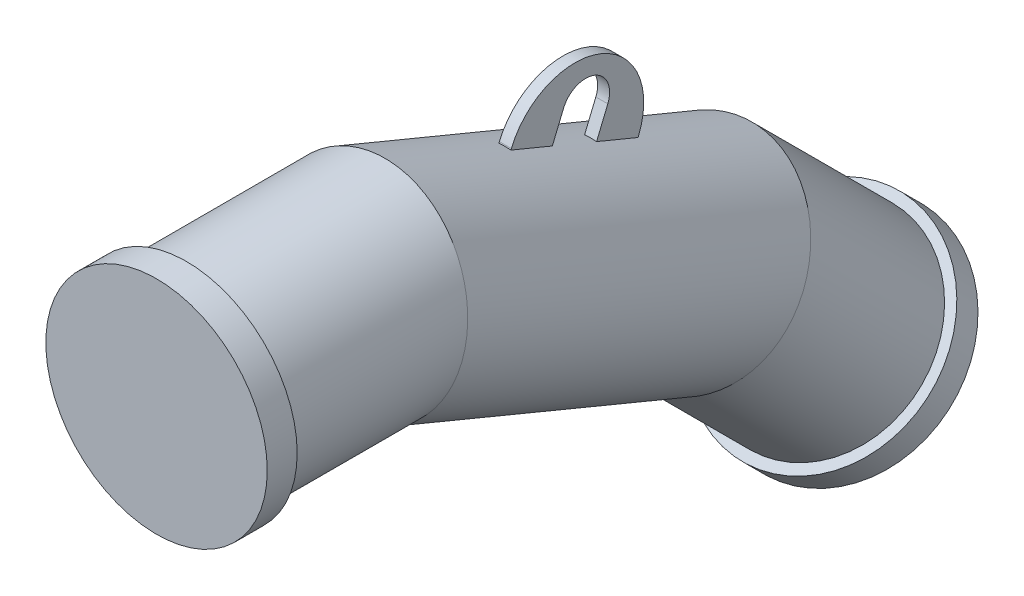
ISO-10303-21;
HEADER;
FILE_DESCRIPTION(('STEP AP214'),'2;1');
FILE_NAME('part.step','',(''),(''),'','','');
FILE_SCHEMA(('AUTOMOTIVE_DESIGN { 1 0 10303 214 1 1 1 1 }'));
ENDSEC;
DATA;
#1=APPLICATION_CONTEXT('core data for automotive mechanical design processes');
#2=APPLICATION_PROTOCOL_DEFINITION('international standard','automotive_design',2000,#1);
#3=PRODUCT_CONTEXT('',#1,'mechanical');
#4=PRODUCT('Part','Part','',(#3));
#5=PRODUCT_RELATED_PRODUCT_CATEGORY('part','',(#4));
#6=PRODUCT_DEFINITION_FORMATION('','',#4);
#7=PRODUCT_DEFINITION_CONTEXT('part definition',#1,'design');
#8=PRODUCT_DEFINITION('design','',#6,#7);
#9=PRODUCT_DEFINITION_SHAPE('','',#8);
#10=(LENGTH_UNIT() NAMED_UNIT(*) SI_UNIT(.MILLI.,.METRE.));
#11=(NAMED_UNIT(*) PLANE_ANGLE_UNIT() SI_UNIT($,.RADIAN.));
#12=(NAMED_UNIT(*) SI_UNIT($,.STERADIAN.) SOLID_ANGLE_UNIT());
#13=UNCERTAINTY_MEASURE_WITH_UNIT(LENGTH_MEASURE(1.E-05),#10,'distance_accuracy_value','');
#14=(GEOMETRIC_REPRESENTATION_CONTEXT(3) GLOBAL_UNCERTAINTY_ASSIGNED_CONTEXT((#13)) GLOBAL_UNIT_ASSIGNED_CONTEXT((#10,
#11,#12)) REPRESENTATION_CONTEXT('',''));
#15=CARTESIAN_POINT('',(0.,0.,0.));
#16=DIRECTION('',(0.,0.,1.));
#17=DIRECTION('',(1.,0.,0.));
#18=AXIS2_PLACEMENT_3D('',#15,#16,#17);
#19=CARTESIAN_POINT('',(0.,-219.669914110089,-555.33008588991));
#20=DIRECTION('',(0.,-0.707106781186548,-0.707106781186547));
#21=DIRECTION('',(-1.,0.,0.));
#22=AXIS2_PLACEMENT_3D('',#19,#20,#21);
#23=CYLINDRICAL_SURFACE('',#22,92.5);
#24=CARTESIAN_POINT('',(0.,-219.669914110089,-555.33008588991));
#25=DIRECTION('',(0.,-0.707106781186548,-0.707106781186547));
#26=DIRECTION('',(-1.,0.,0.));
#27=AXIS2_PLACEMENT_3D('',#24,#25,#26);
#28=CIRCLE('',#27,92.5);
#29=CARTESIAN_POINT('',(-92.5,-219.669914110089,-555.33008588991));
#30=VERTEX_POINT('',#29);
#31=EDGE_CURVE('E26',#30,#30,#28,.T.);
#32=ORIENTED_EDGE('',*,*,#31,.T.);
#33=EDGE_LOOP('',(#32));
#34=FACE_BOUND('',#33,.T.);
#35=CARTESIAN_POINT('',(0.,-237.347583639753,-573.007755419574));
#36=DIRECTION('',(0.,-0.707106781186548,-0.707106781186547));
#37=DIRECTION('',(-1.,0.,0.));
#38=AXIS2_PLACEMENT_3D('',#35,#36,#37);
#39=CIRCLE('',#38,92.5);
#40=CARTESIAN_POINT('',(-92.5,-237.347583639753,-573.007755419574));
#41=VERTEX_POINT('',#40);
#42=EDGE_CURVE('E19',#41,#41,#39,.T.);
#43=ORIENTED_EDGE('',*,*,#42,.F.);
#44=EDGE_LOOP('',(#43));
#45=FACE_BOUND('',#44,.T.);
#46=ADVANCED_FACE('F16',(#34,#45),#23,.T.);
#47=CARTESIAN_POINT('',(0.,-219.669914110089,-555.33008588991));
#48=DIRECTION('',(0.,-0.707106781186548,-0.707106781186547));
#49=DIRECTION('',(-1.,0.,0.));
#50=AXIS2_PLACEMENT_3D('',#47,#48,#49);
#51=PLANE('',#50);
#52=CARTESIAN_POINT('',(0.,-219.669914110089,-555.33008588991));
#53=DIRECTION('',(0.,0.707106781186548,0.707106781186547));
#54=DIRECTION('',(1.,0.,0.));
#55=AXIS2_PLACEMENT_3D('',#52,#53,#54);
#56=CIRCLE('',#55,84.15);
#57=CARTESIAN_POINT('',(84.15,-219.669914110089,-555.33008588991));
#58=VERTEX_POINT('',#57);
#59=EDGE_CURVE('E10',#58,#58,#56,.T.);
#60=ORIENTED_EDGE('',*,*,#59,.F.);
#61=EDGE_LOOP('',(#60));
#62=FACE_BOUND('',#61,.T.);
#63=ORIENTED_EDGE('',*,*,#31,.F.);
#64=EDGE_LOOP('',(#63));
#65=FACE_BOUND('',#64,.T.);
#66=ADVANCED_FACE('F371',(#62,#65),#51,.F.);
#67=CARTESIAN_POINT('',(0.,-114.18070123307,-449.84087301289));
#68=DIRECTION('',(0.,0.382683432365089,0.923879532511287));
#69=DIRECTION('',(0.,-0.923879532511287,0.382683432365089));
#70=AXIS2_PLACEMENT_3D('',#67,#68,#69);
#71=CYLINDRICAL_SURFACE('',#70,84.15);
#72=CARTESIAN_POINT('',(0.,-64.7440192638374,-330.490164924042));
#73=DIRECTION('',(0.,-0.38268343236509,-0.923879532511287));
#74=DIRECTION('',(0.,0.923879532511287,-0.38268343236509));
#75=AXIS2_PLACEMENT_3D('',#72,#73,#74);
#76=CIRCLE('',#75,84.15);
#77=CARTESIAN_POINT('',(-5.,12.8630850479172,-362.636080066475));
#78=VERTEX_POINT('',#77);
#79=CARTESIAN_POINT('',(5.,12.8630850479172,-362.636080066475));
#80=VERTEX_POINT('',#79);
#81=EDGE_CURVE('E343',#78,#80,#76,.T.);
#82=ORIENTED_EDGE('',*,*,#81,.F.);
#83=DIRECTION('',(0.,0.382683432365089,0.923879532511287));
#84=VECTOR('',#83,1.);
#85=CARTESIAN_POINT('',(-5.,-36.5735969213154,-481.986788155322));
#86=LINE('',#85,#84);
#87=CARTESIAN_POINT('',(-5.,-1.48754366577374,-397.281562535648));
#88=VERTEX_POINT('',#87);
#89=EDGE_CURVE('E336',#88,#78,#86,.T.);
#90=ORIENTED_EDGE('',*,*,#89,.F.);
#91=CARTESIAN_POINT('',(0.,-79.0946479775282,-365.135647393216));
#92=DIRECTION('',(0.,0.38268343236509,0.923879532511287));
#93=DIRECTION('',(0.,-0.923879532511287,0.38268343236509));
#94=AXIS2_PLACEMENT_3D('',#91,#92,#93);
#95=CIRCLE('',#94,84.15);
#96=CARTESIAN_POINT('',(5.,-1.48754366577375,-397.281562535648));
#97=VERTEX_POINT('',#96);
#98=EDGE_CURVE('E332',#97,#88,#95,.T.);
#99=ORIENTED_EDGE('',*,*,#98,.F.);
#100=DIRECTION('',(0.,0.382683432365089,0.923879532511287));
#101=VECTOR('',#100,1.);
#102=CARTESIAN_POINT('',(5.,-36.5735969213154,-481.986788155322));
#103=LINE('',#102,#101);
#104=EDGE_CURVE('E340',#97,#80,#103,.T.);
#105=ORIENTED_EDGE('',*,*,#104,.T.);
#106=EDGE_LOOP('',(#82,#90,#99,#105));
#107=FACE_BOUND('',#106,.T.);
#108=CARTESIAN_POINT('',(0.,-114.18070123307,-449.84087301289));
#109=DIRECTION('',(0.,-0.555570233019602,-0.831469612302545));
#110=DIRECTION('',(0.,-0.831469612302546,0.555570233019602));
#111=AXIS2_PLACEMENT_3D('',#108,#109,#110);
#112=ELLIPSE('',#111,85.79859596323,84.15);
#113=CARTESIAN_POINT('',(0.,-185.51962655472,-402.173727060843));
#114=VERTEX_POINT('',#113);
#115=EDGE_CURVE('E320',#114,#114,#112,.T.);
#116=ORIENTED_EDGE('',*,*,#115,.F.);
#117=EDGE_LOOP('',(#116));
#118=FACE_BOUND('',#117,.T.);
#119=CARTESIAN_POINT('',(0.,-2.43121495121452E-13,-174.184275534742));
#120=DIRECTION('',(0.,-0.195090322016128,-0.98078528040323));
#121=DIRECTION('',(0.,-0.980785280403231,0.195090322016128));
#122=AXIS2_PLACEMENT_3D('',#119,#120,#121);
#123=ELLIPSE('',#122,85.79859596323,84.15);
#124=CARTESIAN_POINT('',(0.,-84.1500000000002,-157.445799819743));
#125=VERTEX_POINT('',#124);
#126=EDGE_CURVE('E325',#125,#125,#123,.T.);
#127=ORIENTED_EDGE('',*,*,#126,.T.);
#128=EDGE_LOOP('',(#127));
#129=FACE_BOUND('',#128,.T.);
#130=CARTESIAN_POINT('',(0.,-49.4366819692338,-293.534983623591));
#131=DIRECTION('',(0.,0.38268343236509,0.923879532511287));
#132=DIRECTION('',(0.,-0.923879532511287,0.38268343236509));
#133=AXIS2_PLACEMENT_3D('',#130,#131,#132);
#134=CIRCLE('',#133,84.15);
#135=CARTESIAN_POINT('',(5.,28.1704223425207,-325.680898766023));
#136=VERTEX_POINT('',#135);
#137=CARTESIAN_POINT('',(-5.,28.1704223425207,-325.680898766023));
#138=VERTEX_POINT('',#137);
#139=EDGE_CURVE('E39',#136,#138,#134,.T.);
#140=ORIENTED_EDGE('',*,*,#139,.F.);
#141=CARTESIAN_POINT('',(5.,42.5210510562115,-291.03541629685));
#142=VERTEX_POINT('',#141);
#143=EDGE_CURVE('E344',#136,#142,#103,.T.);
#144=ORIENTED_EDGE('',*,*,#143,.T.);
#145=CARTESIAN_POINT('',(0.,-35.086053255543,-258.889501154418));
#146=DIRECTION('',(0.,-0.38268343236509,-0.923879532511287));
#147=DIRECTION('',(0.,0.923879532511287,-0.38268343236509));
#148=AXIS2_PLACEMENT_3D('',#145,#146,#147);
#149=CIRCLE('',#148,84.15);
#150=CARTESIAN_POINT('',(-5.,42.5210510562115,-291.03541629685));
#151=VERTEX_POINT('',#150);
#152=EDGE_CURVE('E348',#151,#142,#149,.T.);
#153=ORIENTED_EDGE('',*,*,#152,.F.);
#154=EDGE_CURVE('E48',#138,#151,#86,.T.);
#155=ORIENTED_EDGE('',*,*,#154,.F.);
#156=EDGE_LOOP('',(#140,#144,#153,#155));
#157=FACE_BOUND('',#156,.T.);
#158=ADVANCED_FACE('F376',(#107,#118,#129,#157),#71,.T.);
#159=CARTESIAN_POINT('',(0.,-2.43121495121452E-13,-174.184275534742));
#160=DIRECTION('',(0.,0.,1.));
#161=DIRECTION('',(1.,0.,0.));
#162=AXIS2_PLACEMENT_3D('',#159,#160,#161);
#163=CYLINDRICAL_SURFACE('',#162,84.15);
#164=CARTESIAN_POINT('',(0.,-2.43121495121452E-13,-24.9999999999986));
#165=DIRECTION('',(0.,0.,-1.));
#166=DIRECTION('',(-1.,0.,0.));
#167=AXIS2_PLACEMENT_3D('',#164,#165,#166);
#168=CIRCLE('',#167,84.15);
#169=CARTESIAN_POINT('',(-84.1500000000001,-2.43121495121452E-13,-24.9999999999986));
#170=VERTEX_POINT('',#169);
#171=EDGE_CURVE('E261',#170,#170,#168,.T.);
#172=ORIENTED_EDGE('',*,*,#171,.T.);
#173=EDGE_LOOP('',(#172));
#174=FACE_BOUND('',#173,.T.);
#175=ORIENTED_EDGE('',*,*,#126,.F.);
#176=EDGE_LOOP('',(#175));
#177=FACE_BOUND('',#176,.T.);
#178=ADVANCED_FACE('F382',(#174,#177),#163,.T.);
#179=CARTESIAN_POINT('',(0.,-114.18070123307,-449.840873012891));
#180=DIRECTION('',(0.,-0.707106781186548,-0.707106781186547));
#181=DIRECTION('',(-1.,0.,0.));
#182=AXIS2_PLACEMENT_3D('',#179,#180,#181);
#183=CYLINDRICAL_SURFACE('',#182,84.15);
#184=ORIENTED_EDGE('',*,*,#59,.T.);
#185=EDGE_LOOP('',(#184));
#186=FACE_BOUND('',#185,.T.);
#187=ORIENTED_EDGE('',*,*,#115,.T.);
#188=EDGE_LOOP('',(#187));
#189=FACE_BOUND('',#188,.T.);
#190=ADVANCED_FACE('F425',(#186,#189),#183,.T.);
#191=CARTESIAN_POINT('',(5.,43.1505786609395,-353.533726685429));
#192=DIRECTION('',(1.,0.,0.));
#193=DIRECTION('',(0.,0.923879532511287,-0.38268343236509));
#194=AXIS2_PLACEMENT_3D('',#191,#192,#193);
#195=PLANE('',#194);
#196=ORIENTED_EDGE('',*,*,#104,.F.);
#197=DIRECTION('',(0.,0.923879532511287,-0.38268343236509));
#198=VECTOR('',#197,1.);
#199=CARTESIAN_POINT('',(5.,-9.80368303918138,-393.836904820598));
#200=LINE('',#199,#198);
#201=CARTESIAN_POINT('',(5.,-0.564887714068485,-397.663739144248));
#202=VERTEX_POINT('',#201);
#203=EDGE_CURVE('E265',#97,#202,#200,.T.);
#204=ORIENTED_EDGE('',*,*,#203,.T.);
#205=CARTESIAN_POINT('',(5.,21.4394096469243,-344.54066602485));
#206=DIRECTION('',(1.,0.,0.));
#207=DIRECTION('',(0.,0.923879532511287,-0.38268343236509));
#208=AXIS2_PLACEMENT_3D('',#205,#206,#207);
#209=CIRCLE('',#208,57.5);
#210=CARTESIAN_POINT('',(5.,43.4437070079169,-291.417592905451));
#211=VERTEX_POINT('',#210);
#212=EDGE_CURVE('E289',#202,#211,#209,.T.);
#213=ORIENTED_EDGE('',*,*,#212,.T.);
#214=DIRECTION('',(0.,0.923879532511287,-0.38268343236509));
#215=VECTOR('',#214,1.);
#216=CARTESIAN_POINT('',(5.,34.204911682804,-287.5907585818));
#217=LINE('',#216,#215);
#218=EDGE_CURVE('E271',#142,#211,#217,.T.);
#219=ORIENTED_EDGE('',*,*,#218,.F.);
#220=ORIENTED_EDGE('',*,*,#143,.F.);
#221=DIRECTION('',(0.,0.923879532511287,-0.38268343236509));
#222=VECTOR('',#221,1.);
#223=CARTESIAN_POINT('',(5.,29.093078294226,-326.063075374624));
#224=LINE('',#223,#222);
#225=CARTESIAN_POINT('',(5.,50.8042473082413,-335.056136035203));
#226=VERTEX_POINT('',#225);
#227=EDGE_CURVE('E278',#136,#226,#224,.T.);
#228=ORIENTED_EDGE('',*,*,#227,.T.);
#229=CARTESIAN_POINT('',(5.,43.1505786609395,-353.533726685429));
#230=DIRECTION('',(-1.,0.,0.));
#231=DIRECTION('',(0.,0.923879532511287,-0.38268343236509));
#232=AXIS2_PLACEMENT_3D('',#229,#230,#231);
#233=CIRCLE('',#232,20.);
#234=CARTESIAN_POINT('',(5.,35.4969100136377,-372.011317335655));
#235=VERTEX_POINT('',#234);
#236=EDGE_CURVE('E281',#226,#235,#233,.T.);
#237=ORIENTED_EDGE('',*,*,#236,.T.);
#238=DIRECTION('',(0.,-0.923879532511287,0.38268343236509));
#239=VECTOR('',#238,1.);
#240=CARTESIAN_POINT('',(5.,13.7857409996224,-363.018256675075));
#241=LINE('',#240,#239);
#242=EDGE_CURVE('E285',#235,#80,#241,.T.);
#243=ORIENTED_EDGE('',*,*,#242,.T.);
#244=EDGE_LOOP('',(#196,#204,#213,#219,#220,#228,#237,#243));
#245=FACE_BOUND('',#244,.T.);
#246=ADVANCED_FACE('F421',(#245),#195,.T.);
#247=CARTESIAN_POINT('',(-5.,43.1505786609395,-353.533726685429));
#248=DIRECTION('',(1.,0.,0.));
#249=DIRECTION('',(0.,0.923879532511287,-0.38268343236509));
#250=AXIS2_PLACEMENT_3D('',#247,#248,#249);
#251=PLANE('',#250);
#252=DIRECTION('',(0.,0.923879532511287,-0.38268343236509));
#253=VECTOR('',#252,1.);
#254=CARTESIAN_POINT('',(-5.,-9.80368303918138,-393.836904820598));
#255=LINE('',#254,#253);
#256=CARTESIAN_POINT('',(-5.,-0.564887714068513,-397.663739144249));
#257=VERTEX_POINT('',#256);
#258=EDGE_CURVE('E268',#88,#257,#255,.T.);
#259=ORIENTED_EDGE('',*,*,#258,.F.);
#260=ORIENTED_EDGE('',*,*,#89,.T.);
#261=DIRECTION('',(0.,-0.923879532511287,0.38268343236509));
#262=VECTOR('',#261,1.);
#263=CARTESIAN_POINT('',(-5.,13.7857409996224,-363.018256675075));
#264=LINE('',#263,#262);
#265=CARTESIAN_POINT('',(-5.,35.4969100136377,-372.011317335655));
#266=VERTEX_POINT('',#265);
#267=EDGE_CURVE('E299',#266,#78,#264,.T.);
#268=ORIENTED_EDGE('',*,*,#267,.F.);
#269=CARTESIAN_POINT('',(-5.,43.1505786609395,-353.533726685429));
#270=DIRECTION('',(-1.,0.,0.));
#271=DIRECTION('',(0.,0.923879532511287,-0.38268343236509));
#272=AXIS2_PLACEMENT_3D('',#269,#270,#271);
#273=CIRCLE('',#272,20.);
#274=CARTESIAN_POINT('',(-5.,50.8042473082413,-335.056136035203));
#275=VERTEX_POINT('',#274);
#276=EDGE_CURVE('E296',#275,#266,#273,.T.);
#277=ORIENTED_EDGE('',*,*,#276,.F.);
#278=DIRECTION('',(0.,0.923879532511287,-0.38268343236509));
#279=VECTOR('',#278,1.);
#280=CARTESIAN_POINT('',(-5.,29.093078294226,-326.063075374624));
#281=LINE('',#280,#279);
#282=EDGE_CURVE('E277',#138,#275,#281,.T.);
#283=ORIENTED_EDGE('',*,*,#282,.F.);
#284=ORIENTED_EDGE('',*,*,#154,.T.);
#285=DIRECTION('',(0.,0.923879532511287,-0.38268343236509));
#286=VECTOR('',#285,1.);
#287=CARTESIAN_POINT('',(-5.,34.204911682804,-287.5907585818));
#288=LINE('',#287,#286);
#289=CARTESIAN_POINT('',(-5.,43.4437070079169,-291.417592905451));
#290=VERTEX_POINT('',#289);
#291=EDGE_CURVE('E274',#151,#290,#288,.T.);
#292=ORIENTED_EDGE('',*,*,#291,.T.);
#293=CARTESIAN_POINT('',(-5.,21.4394096469243,-344.54066602485));
#294=DIRECTION('',(1.,0.,0.));
#295=DIRECTION('',(0.,0.923879532511287,-0.38268343236509));
#296=AXIS2_PLACEMENT_3D('',#293,#294,#295);
#297=CIRCLE('',#296,57.5);
#298=EDGE_CURVE('E282',#257,#290,#297,.T.);
#299=ORIENTED_EDGE('',*,*,#298,.F.);
#300=EDGE_LOOP('',(#259,#260,#268,#277,#283,#284,#292,#299));
#301=FACE_BOUND('',#300,.T.);
#302=ADVANCED_FACE('F424',(#301),#251,.F.);
#303=CARTESIAN_POINT('',(5.,29.093078294226,-326.063075374624));
#304=DIRECTION('',(0.,0.38268343236509,0.923879532511287));
#305=DIRECTION('',(0.,-0.923879532511287,0.38268343236509));
#306=AXIS2_PLACEMENT_3D('',#303,#304,#305);
#307=PLANE('',#306);
#308=ORIENTED_EDGE('',*,*,#227,.F.);
#309=ORIENTED_EDGE('',*,*,#139,.T.);
#310=ORIENTED_EDGE('',*,*,#282,.T.);
#311=DIRECTION('',(-1.,0.,0.));
#312=VECTOR('',#311,1.);
#313=CARTESIAN_POINT('',(5.,50.8042473082413,-335.056136035203));
#314=LINE('',#313,#312);
#315=EDGE_CURVE('E317',#226,#275,#314,.T.);
#316=ORIENTED_EDGE('',*,*,#315,.F.);
#317=EDGE_LOOP('',(#308,#309,#310,#316));
#318=FACE_BOUND('',#317,.T.);
#319=ADVANCED_FACE('F429',(#318),#307,.F.);
#320=CARTESIAN_POINT('',(5.,43.1505786609395,-353.533726685429));
#321=DIRECTION('',(-1.,0.,0.));
#322=DIRECTION('',(0.,-0.923879532511287,0.38268343236509));
#323=AXIS2_PLACEMENT_3D('',#320,#321,#322);
#324=CYLINDRICAL_SURFACE('',#323,20.);
#325=ORIENTED_EDGE('',*,*,#276,.T.);
#326=DIRECTION('',(-1.,0.,0.));
#327=VECTOR('',#326,1.);
#328=CARTESIAN_POINT('',(5.,35.4969100136377,-372.011317335655));
#329=LINE('',#328,#327);
#330=EDGE_CURVE('E313',#235,#266,#329,.T.);
#331=ORIENTED_EDGE('',*,*,#330,.F.);
#332=ORIENTED_EDGE('',*,*,#236,.F.);
#333=ORIENTED_EDGE('',*,*,#315,.T.);
#334=EDGE_LOOP('',(#325,#331,#332,#333));
#335=FACE_BOUND('',#334,.T.);
#336=ADVANCED_FACE('F437',(#335),#324,.F.);
#337=CARTESIAN_POINT('',(5.,13.7857409996224,-363.018256675075));
#338=DIRECTION('',(0.,-0.38268343236509,-0.923879532511287));
#339=DIRECTION('',(0.,0.923879532511287,-0.38268343236509));
#340=AXIS2_PLACEMENT_3D('',#337,#338,#339);
#341=PLANE('',#340);
#342=ORIENTED_EDGE('',*,*,#267,.T.);
#343=ORIENTED_EDGE('',*,*,#81,.T.);
#344=ORIENTED_EDGE('',*,*,#242,.F.);
#345=ORIENTED_EDGE('',*,*,#330,.T.);
#346=EDGE_LOOP('',(#342,#343,#344,#345));
#347=FACE_BOUND('',#346,.T.);
#348=ADVANCED_FACE('F433',(#347),#341,.F.);
#349=CARTESIAN_POINT('',(5.,21.4394096469243,-344.54066602485));
#350=DIRECTION('',(-1.,0.,0.));
#351=DIRECTION('',(0.,-0.923879532511287,0.38268343236509));
#352=AXIS2_PLACEMENT_3D('',#349,#350,#351);
#353=CYLINDRICAL_SURFACE('',#352,57.5);
#354=ORIENTED_EDGE('',*,*,#298,.T.);
#355=DIRECTION('',(-1.,0.,0.));
#356=VECTOR('',#355,1.);
#357=CARTESIAN_POINT('',(5.,43.4437070079169,-291.417592905451));
#358=LINE('',#357,#356);
#359=EDGE_CURVE('E293',#211,#290,#358,.T.);
#360=ORIENTED_EDGE('',*,*,#359,.F.);
#361=ORIENTED_EDGE('',*,*,#212,.F.);
#362=DIRECTION('',(-1.,0.,0.));
#363=VECTOR('',#362,1.);
#364=CARTESIAN_POINT('',(5.,-0.564887714068485,-397.663739144248));
#365=LINE('',#364,#363);
#366=EDGE_CURVE('E309',#202,#257,#365,.T.);
#367=ORIENTED_EDGE('',*,*,#366,.T.);
#368=EDGE_LOOP('',(#354,#360,#361,#367));
#369=FACE_BOUND('',#368,.T.);
#370=ADVANCED_FACE('F419',(#369),#353,.T.);
#371=CARTESIAN_POINT('',(5.,34.204911682804,-287.5907585818));
#372=DIRECTION('',(0.,-0.38268343236509,-0.923879532511287));
#373=DIRECTION('',(0.,0.923879532511287,-0.38268343236509));
#374=AXIS2_PLACEMENT_3D('',#371,#372,#373);
#375=PLANE('',#374);
#376=ORIENTED_EDGE('',*,*,#291,.F.);
#377=ORIENTED_EDGE('',*,*,#152,.T.);
#378=ORIENTED_EDGE('',*,*,#218,.T.);
#379=ORIENTED_EDGE('',*,*,#359,.T.);
#380=EDGE_LOOP('',(#376,#377,#378,#379));
#381=FACE_BOUND('',#380,.T.);
#382=ADVANCED_FACE('F415',(#381),#375,.F.);
#383=CARTESIAN_POINT('',(-5.,-9.80368303918138,-393.836904820598));
#384=DIRECTION('',(0.,0.38268343236509,0.923879532511287));
#385=DIRECTION('',(0.,-0.923879532511287,0.38268343236509));
#386=AXIS2_PLACEMENT_3D('',#383,#384,#385);
#387=PLANE('',#386);
#388=ORIENTED_EDGE('',*,*,#203,.F.);
#389=ORIENTED_EDGE('',*,*,#98,.T.);
#390=ORIENTED_EDGE('',*,*,#258,.T.);
#391=ORIENTED_EDGE('',*,*,#366,.F.);
#392=EDGE_LOOP('',(#388,#389,#390,#391));
#393=FACE_BOUND('',#392,.T.);
#394=ADVANCED_FACE('F410',(#393),#387,.F.);
#395=CARTESIAN_POINT('',(0.,0.,0.));
#396=DIRECTION('',(0.,0.,1.));
#397=DIRECTION('',(1.,0.,0.));
#398=AXIS2_PLACEMENT_3D('',#395,#396,#397);
#399=PLANE('',#398);
#400=CARTESIAN_POINT('',(0.,0.,0.));
#401=DIRECTION('',(0.,0.,1.));
#402=DIRECTION('',(1.,0.,0.));
#403=AXIS2_PLACEMENT_3D('',#400,#401,#402);
#404=CIRCLE('',#403,92.5);
#405=CARTESIAN_POINT('',(92.5,0.,0.));
#406=VERTEX_POINT('',#405);
#407=EDGE_CURVE('E249',#406,#406,#404,.T.);
#408=ORIENTED_EDGE('',*,*,#407,.T.);
#409=EDGE_LOOP('',(#408));
#410=FACE_BOUND('',#409,.T.);
#411=ADVANCED_FACE('F400',(#410),#399,.T.);
#412=CARTESIAN_POINT('',(0.,0.,-25.));
#413=DIRECTION('',(0.,0.,1.));
#414=DIRECTION('',(1.,0.,0.));
#415=AXIS2_PLACEMENT_3D('',#412,#413,#414);
#416=CYLINDRICAL_SURFACE('',#415,92.5);
#417=CARTESIAN_POINT('',(0.,0.,-25.));
#418=DIRECTION('',(0.,0.,1.));
#419=DIRECTION('',(1.,0.,0.));
#420=AXIS2_PLACEMENT_3D('',#417,#418,#419);
#421=CIRCLE('',#420,92.5);
#422=CARTESIAN_POINT('',(92.5,0.,-25.));
#423=VERTEX_POINT('',#422);
#424=EDGE_CURVE('E257',#423,#423,#421,.T.);
#425=ORIENTED_EDGE('',*,*,#424,.T.);
#426=EDGE_LOOP('',(#425));
#427=FACE_BOUND('',#426,.T.);
#428=ORIENTED_EDGE('',*,*,#407,.F.);
#429=EDGE_LOOP('',(#428));
#430=FACE_BOUND('',#429,.T.);
#431=ADVANCED_FACE('F394',(#427,#430),#416,.T.);
#432=CARTESIAN_POINT('',(0.,0.,-25.));
#433=DIRECTION('',(0.,0.,1.));
#434=DIRECTION('',(1.,0.,0.));
#435=AXIS2_PLACEMENT_3D('',#432,#433,#434);
#436=PLANE('',#435);
#437=ORIENTED_EDGE('',*,*,#171,.F.);
#438=EDGE_LOOP('',(#437));
#439=FACE_BOUND('',#438,.T.);
#440=ORIENTED_EDGE('',*,*,#424,.F.);
#441=EDGE_LOOP('',(#440));
#442=FACE_BOUND('',#441,.T.);
#443=ADVANCED_FACE('F389',(#439,#442),#436,.F.);
#444=CARTESIAN_POINT('',(0.,-237.347583639753,-573.007755419574));
#445=DIRECTION('',(0.,-0.707106781186548,-0.707106781186547));
#446=DIRECTION('',(-1.,0.,0.));
#447=AXIS2_PLACEMENT_3D('',#444,#445,#446);
#448=PLANE('',#447);
#449=ORIENTED_EDGE('',*,*,#42,.T.);
#450=EDGE_LOOP('',(#449));
#451=FACE_BOUND('',#450,.T.);
#452=ADVANCED_FACE('F368',(#451),#448,.T.);
#453=CLOSED_SHELL('',(#46,#66,#158,#178,#190,#246,#302,#319,#336,#348,#370,#382,#394,#411,#431,
#443,#452));
#454=CARTESIAN_POINT('',(0.,0.,-25.));
#455=DIRECTION('',(0.,0.,1.));
#456=DIRECTION('',(1.,0.,0.));
#457=AXIS2_PLACEMENT_3D('',#454,#455,#456);
#458=PLANE('',#457);
#459=CARTESIAN_POINT('',(0.,-2.41590686622518E-13,-24.9999999999986));
#460=DIRECTION('',(0.,0.,-1.));
#461=DIRECTION('',(0.,1.,0.));
#462=AXIS2_PLACEMENT_3D('',#459,#460,#461);
#463=CIRCLE('',#462,35.);
#464=CARTESIAN_POINT('',(0.,34.9999999999998,-24.9999999999986));
#465=VERTEX_POINT('',#464);
#466=EDGE_CURVE('E244',#465,#465,#463,.T.);
#467=ORIENTED_EDGE('',*,*,#466,.T.);
#468=EDGE_LOOP('',(#467));
#469=FACE_BOUND('',#468,.T.);
#470=ADVANCED_FACE('F1076',(#469),#458,.F.);
#471=CARTESIAN_POINT('',(0.,-750.,-24.9999999999986));
#472=DIRECTION('',(-1.,0.,0.));
#473=DIRECTION('',(0.,0.,1.));
#474=AXIS2_PLACEMENT_3D('',#471,#472,#473);
#475=TOROIDAL_SURFACE('',#474,750.,35.);
#476=CARTESIAN_POINT('',(0.,-219.669914110089,-555.33008588991));
#477=DIRECTION('',(0.,-0.707106781186548,-0.707106781186547));
#478=DIRECTION('',(-1.,0.,0.));
#479=AXIS2_PLACEMENT_3D('',#476,#477,#478);
#480=CIRCLE('',#479,35.);
#481=CARTESIAN_POINT('',(0.,-194.921176768561,-580.078823231439));
#482=VERTEX_POINT('',#481);
#483=EDGE_CURVE('E250',#482,#482,#480,.T.);
#484=CARTESIAN_POINT('',(0.,-750.,-24.9999999999986));
#485=DIRECTION('',(-1.,0.,0.));
#486=DIRECTION('',(0.,0.,1.));
#487=AXIS2_PLACEMENT_3D('',#484,#485,#486);
#488=CIRCLE('',#487,785.);
#489=EDGE_CURVE('',#465,#482,#488,.T.);
#490=ORIENTED_EDGE('',*,*,#466,.F.);
#491=ORIENTED_EDGE('',*,*,#483,.T.);
#492=ORIENTED_EDGE('',*,*,#489,.T.);
#493=ORIENTED_EDGE('',*,*,#489,.F.);
#494=EDGE_LOOP('',(#490,#492,#491,#493));
#495=FACE_BOUND('',#494,.T.);
#496=ADVANCED_FACE('F1064',(#495),#475,.F.);
#497=CARTESIAN_POINT('',(0.,-219.669914110089,-555.33008588991));
#498=DIRECTION('',(0.,-0.707106781186548,-0.707106781186547));
#499=DIRECTION('',(-1.,0.,0.));
#500=AXIS2_PLACEMENT_3D('',#497,#498,#499);
#501=CYLINDRICAL_SURFACE('',#500,35.);
#502=CARTESIAN_POINT('',(0.,-233.81204973382,-569.472221513641));
#503=DIRECTION('',(0.,0.707106781186548,0.707106781186547));
#504=DIRECTION('',(0.,-0.707106781186547,0.707106781186548));
#505=AXIS2_PLACEMENT_3D('',#502,#503,#504);
#506=CIRCLE('',#505,35.);
#507=CARTESIAN_POINT('',(0.,-258.560787075349,-544.723484172112));
#508=VERTEX_POINT('',#507);
#509=EDGE_CURVE('E245',#508,#508,#506,.F.);
#510=ORIENTED_EDGE('',*,*,#509,.T.);
#511=EDGE_LOOP('',(#510));
#512=FACE_BOUND('',#511,.T.);
#513=ORIENTED_EDGE('',*,*,#483,.F.);
#514=EDGE_LOOP('',(#513));
#515=FACE_BOUND('',#514,.T.);
#516=ADVANCED_FACE('F407',(#512,#515),#501,.F.);
#517=CARTESIAN_POINT('',(0.,-233.81204973382,-569.472221513641));
#518=DIRECTION('',(0.,0.707106781186548,0.707106781186547));
#519=DIRECTION('',(1.,0.,0.));
#520=AXIS2_PLACEMENT_3D('',#517,#518,#519);
#521=PLANE('',#520);
#522=ORIENTED_EDGE('',*,*,#509,.F.);
#523=EDGE_LOOP('',(#522));
#524=FACE_BOUND('',#523,.T.);
#525=ADVANCED_FACE('F606',(#524),#521,.T.);
#526=CLOSED_SHELL('',(#470,#496,#516,#525));
#527=CARTESIAN_POINT('',(-27.7445488464686,66.9812661070684,-20.));
#528=DIRECTION('',(0.,0.,1.));
#529=DIRECTION('',(1.,0.,0.));
#530=AXIS2_PLACEMENT_3D('',#527,#528,#529);
#531=PLANE('',#530);
#532=CARTESIAN_POINT('',(-27.7445488464686,66.9812661070684,-20.));
#533=DIRECTION('',(0.,0.,1.));
#534=DIRECTION('',(1.,0.,0.));
#535=AXIS2_PLACEMENT_3D('',#532,#533,#534);
#536=CIRCLE('',#535,7.);
#537=CARTESIAN_POINT('',(-20.7445488464686,66.9812661070684,-20.));
#538=VERTEX_POINT('',#537);
#539=EDGE_CURVE('E178',#538,#538,#536,.T.);
#540=ORIENTED_EDGE('',*,*,#539,.F.);
#541=EDGE_LOOP('',(#540));
#542=FACE_BOUND('',#541,.T.);
#543=ADVANCED_FACE('F499',(#542),#531,.F.);
#544=CARTESIAN_POINT('',(-27.7445488464686,66.9812661070684,-20.));
#545=DIRECTION('',(0.,0.,1.));
#546=DIRECTION('',(1.,0.,0.));
#547=AXIS2_PLACEMENT_3D('',#544,#545,#546);
#548=CONICAL_SURFACE('',#547,7.,1.02974425867665);
#549=CARTESIAN_POINT('',(-27.7445488464686,66.9812661070684,-24.2060243331929));
#550=VERTEX_POINT('',#549);
#551=VERTEX_LOOP('',#550);
#552=FACE_BOUND('',#551,.T.);
#553=ORIENTED_EDGE('',*,*,#539,.T.);
#554=EDGE_LOOP('',(#553));
#555=FACE_BOUND('',#554,.T.);
#556=ADVANCED_FACE('F494',(#552,#555),#548,.F.);
#557=CLOSED_SHELL('',(#543,#556));
#558=CARTESIAN_POINT('',(66.9812661070678,-203.587089385721,-578.483978426143));
#559=DIRECTION('',(0.,-0.707106781186548,-0.707106781186547));
#560=DIRECTION('',(0.,0.707106781186547,-0.707106781186548));
#561=AXIS2_PLACEMENT_3D('',#558,#559,#560);
#562=PLANE('',#561);
#563=CARTESIAN_POINT('',(66.9812661070678,-203.587089385721,-578.483978426143));
#564=DIRECTION('',(0.,-0.707106781186548,-0.707106781186547));
#565=DIRECTION('',(-1.,0.,0.));
#566=AXIS2_PLACEMENT_3D('',#563,#564,#565);
#567=CIRCLE('',#566,6.99999999999999);
#568=CARTESIAN_POINT('',(59.9812661070678,-203.587089385721,-578.483978426143));
#569=VERTEX_POINT('',#568);
#570=EDGE_CURVE('E187',#569,#569,#567,.T.);
#571=ORIENTED_EDGE('',*,*,#570,.F.);
#572=EDGE_LOOP('',(#571));
#573=FACE_BOUND('',#572,.T.);
#574=ADVANCED_FACE('F770',(#573),#562,.F.);
#575=CARTESIAN_POINT('',(66.9812661070678,-203.587089385721,-578.483978426143));
#576=DIRECTION('',(0.,-0.707106781186548,-0.707106781186547));
#577=DIRECTION('',(-1.,0.,0.));
#578=AXIS2_PLACEMENT_3D('',#575,#576,#577);
#579=CONICAL_SURFACE('',#578,6.99999999999999,1.02974425867665);
#580=CARTESIAN_POINT('',(66.9812661070678,-200.612981057885,-575.509870098307));
#581=VERTEX_POINT('',#580);
#582=VERTEX_LOOP('',#581);
#583=FACE_BOUND('',#582,.T.);
#584=ORIENTED_EDGE('',*,*,#570,.T.);
#585=EDGE_LOOP('',(#584));
#586=FACE_BOUND('',#585,.T.);
#587=ADVANCED_FACE('F773',(#583,#586),#579,.F.);
#588=CLOSED_SHELL('',(#574,#587));
#589=CARTESIAN_POINT('',(66.9812661070687,-242.823806646321,-539.247261165544));
#590=DIRECTION('',(0.,-0.707106781186548,-0.707106781186547));
#591=DIRECTION('',(0.,0.707106781186547,-0.707106781186548));
#592=AXIS2_PLACEMENT_3D('',#589,#590,#591);
#593=PLANE('',#592);
#594=CARTESIAN_POINT('',(66.9812661070687,-242.823806646321,-539.247261165544));
#595=DIRECTION('',(0.,-0.707106781186548,-0.707106781186547));
#596=DIRECTION('',(-1.,0.,0.));
#597=AXIS2_PLACEMENT_3D('',#594,#595,#596);
#598=CIRCLE('',#597,6.99999999999999);
#599=CARTESIAN_POINT('',(59.9812661070687,-242.823806646321,-539.247261165544));
#600=VERTEX_POINT('',#599);
#601=EDGE_CURVE('E218',#600,#600,#598,.T.);
#602=ORIENTED_EDGE('',*,*,#601,.F.);
#603=EDGE_LOOP('',(#602));
#604=FACE_BOUND('',#603,.T.);
#605=ADVANCED_FACE('F1020',(#604),#593,.F.);
#606=CARTESIAN_POINT('',(66.9812661070687,-242.823806646321,-539.247261165544));
#607=DIRECTION('',(0.,-0.707106781186548,-0.707106781186547));
#608=DIRECTION('',(-1.,0.,0.));
#609=AXIS2_PLACEMENT_3D('',#606,#607,#608);
#610=CONICAL_SURFACE('',#609,6.99999999999999,1.02974425867665);
#611=CARTESIAN_POINT('',(66.9812661070687,-239.849698318484,-536.273152837707));
#612=VERTEX_POINT('',#611);
#613=VERTEX_LOOP('',#612);
#614=FACE_BOUND('',#613,.T.);
#615=ORIENTED_EDGE('',*,*,#601,.T.);
#616=EDGE_LOOP('',(#615));
#617=FACE_BOUND('',#616,.T.);
#618=ADVANCED_FACE('F1015',(#614,#617),#610,.F.);
#619=CLOSED_SHELL('',(#605,#618));
#620=CARTESIAN_POINT('',(27.74454884647,-270.56835549279,-511.502712319074));
#621=DIRECTION('',(0.,-0.707106781186548,-0.707106781186547));
#622=DIRECTION('',(0.,0.707106781186547,-0.707106781186548));
#623=AXIS2_PLACEMENT_3D('',#620,#621,#622);
#624=PLANE('',#623);
#625=CARTESIAN_POINT('',(27.74454884647,-270.56835549279,-511.502712319074));
#626=DIRECTION('',(0.,-0.707106781186548,-0.707106781186547));
#627=DIRECTION('',(-1.,0.,0.));
#628=AXIS2_PLACEMENT_3D('',#625,#626,#627);
#629=CIRCLE('',#628,7.);
#630=CARTESIAN_POINT('',(20.74454884647,-270.56835549279,-511.502712319074));
#631=VERTEX_POINT('',#630);
#632=EDGE_CURVE('E213',#631,#631,#629,.T.);
#633=ORIENTED_EDGE('',*,*,#632,.F.);
#634=EDGE_LOOP('',(#633));
#635=FACE_BOUND('',#634,.T.);
#636=ADVANCED_FACE('F997',(#635),#624,.F.);
#637=CARTESIAN_POINT('',(27.74454884647,-270.56835549279,-511.502712319074));
#638=DIRECTION('',(0.,-0.707106781186548,-0.707106781186547));
#639=DIRECTION('',(-1.,0.,0.));
#640=AXIS2_PLACEMENT_3D('',#637,#638,#639);
#641=CONICAL_SURFACE('',#640,7.,1.02974425867665);
#642=CARTESIAN_POINT('',(27.74454884647,-267.594247164954,-508.528603991238));
#643=VERTEX_POINT('',#642);
#644=VERTEX_LOOP('',#643);
#645=FACE_BOUND('',#644,.T.);
#646=ORIENTED_EDGE('',*,*,#632,.T.);
#647=EDGE_LOOP('',(#646));
#648=FACE_BOUND('',#647,.T.);
#649=ADVANCED_FACE('F992',(#645,#648),#641,.F.);
#650=CLOSED_SHELL('',(#636,#649));
#651=CARTESIAN_POINT('',(-27.7445488464686,-270.568355492791,-511.502712319074));
#652=DIRECTION('',(0.,-0.707106781186548,-0.707106781186547));
#653=DIRECTION('',(0.,0.707106781186547,-0.707106781186548));
#654=AXIS2_PLACEMENT_3D('',#651,#652,#653);
#655=PLANE('',#654);
#656=CARTESIAN_POINT('',(-27.7445488464686,-270.568355492791,-511.502712319074));
#657=DIRECTION('',(0.,-0.707106781186548,-0.707106781186547));
#658=DIRECTION('',(-1.,0.,0.));
#659=AXIS2_PLACEMENT_3D('',#656,#657,#658);
#660=CIRCLE('',#659,6.99999999999999);
#661=CARTESIAN_POINT('',(-34.7445488464686,-270.568355492791,-511.502712319074));
#662=VERTEX_POINT('',#661);
#663=EDGE_CURVE('E217',#662,#662,#660,.T.);
#664=ORIENTED_EDGE('',*,*,#663,.F.);
#665=EDGE_LOOP('',(#664));
#666=FACE_BOUND('',#665,.T.);
#667=ADVANCED_FACE('F656',(#666),#655,.F.);
#668=CARTESIAN_POINT('',(-27.7445488464686,-270.568355492791,-511.502712319074));
#669=DIRECTION('',(0.,-0.707106781186548,-0.707106781186547));
#670=DIRECTION('',(-1.,0.,0.));
#671=AXIS2_PLACEMENT_3D('',#668,#669,#670);
#672=CONICAL_SURFACE('',#671,6.99999999999999,1.02974425867665);
#673=CARTESIAN_POINT('',(-27.7445488464686,-267.594247164954,-508.528603991238));
#674=VERTEX_POINT('',#673);
#675=VERTEX_LOOP('',#674);
#676=FACE_BOUND('',#675,.T.);
#677=ORIENTED_EDGE('',*,*,#663,.T.);
#678=EDGE_LOOP('',(#677));
#679=FACE_BOUND('',#678,.T.);
#680=ADVANCED_FACE('F653',(#676,#679),#672,.F.);
#681=CLOSED_SHELL('',(#667,#680));
#682=CARTESIAN_POINT('',(-66.981266107068,-242.823806646322,-539.247261165542));
#683=DIRECTION('',(0.,-0.707106781186548,-0.707106781186547));
#684=DIRECTION('',(0.,0.707106781186547,-0.707106781186548));
#685=AXIS2_PLACEMENT_3D('',#682,#683,#684);
#686=PLANE('',#685);
#687=CARTESIAN_POINT('',(-66.981266107068,-242.823806646322,-539.247261165542));
#688=DIRECTION('',(0.,-0.707106781186548,-0.707106781186547));
#689=DIRECTION('',(-1.,0.,0.));
#690=AXIS2_PLACEMENT_3D('',#687,#688,#689);
#691=CIRCLE('',#690,6.99999999999999);
#692=CARTESIAN_POINT('',(-73.981266107068,-242.823806646322,-539.247261165542));
#693=VERTEX_POINT('',#692);
#694=EDGE_CURVE('E234',#693,#693,#691,.T.);
#695=ORIENTED_EDGE('',*,*,#694,.F.);
#696=EDGE_LOOP('',(#695));
#697=FACE_BOUND('',#696,.T.);
#698=ADVANCED_FACE('F579',(#697),#686,.F.);
#699=CARTESIAN_POINT('',(-66.981266107068,-242.823806646322,-539.247261165542));
#700=DIRECTION('',(0.,-0.707106781186548,-0.707106781186547));
#701=DIRECTION('',(-1.,0.,0.));
#702=AXIS2_PLACEMENT_3D('',#699,#700,#701);
#703=CONICAL_SURFACE('',#702,6.99999999999999,1.02974425867665);
#704=CARTESIAN_POINT('',(-66.981266107068,-239.849698318486,-536.273152837706));
#705=VERTEX_POINT('',#704);
#706=VERTEX_LOOP('',#705);
#707=FACE_BOUND('',#706,.T.);
#708=ORIENTED_EDGE('',*,*,#694,.T.);
#709=EDGE_LOOP('',(#708));
#710=FACE_BOUND('',#709,.T.);
#711=ADVANCED_FACE('F576',(#707,#710),#703,.F.);
#712=CLOSED_SHELL('',(#698,#711));
#713=CARTESIAN_POINT('',(-66.9812661070685,-203.587089385723,-578.483978426142));
#714=DIRECTION('',(0.,-0.707106781186548,-0.707106781186547));
#715=DIRECTION('',(0.,0.707106781186547,-0.707106781186548));
#716=AXIS2_PLACEMENT_3D('',#713,#714,#715);
#717=PLANE('',#716);
#718=CARTESIAN_POINT('',(-66.9812661070685,-203.587089385723,-578.483978426142));
#719=DIRECTION('',(0.,-0.707106781186548,-0.707106781186547));
#720=DIRECTION('',(-1.,0.,0.));
#721=AXIS2_PLACEMENT_3D('',#718,#719,#720);
#722=CIRCLE('',#721,6.99999999999999);
#723=CARTESIAN_POINT('',(-73.9812661070685,-203.587089385723,-578.483978426142));
#724=VERTEX_POINT('',#723);
#725=EDGE_CURVE('E230',#724,#724,#722,.T.);
#726=ORIENTED_EDGE('',*,*,#725,.F.);
#727=EDGE_LOOP('',(#726));
#728=FACE_BOUND('',#727,.T.);
#729=ADVANCED_FACE('F511',(#728),#717,.F.);
#730=CARTESIAN_POINT('',(-66.9812661070685,-203.587089385723,-578.483978426142));
#731=DIRECTION('',(0.,-0.707106781186548,-0.707106781186547));
#732=DIRECTION('',(-1.,0.,0.));
#733=AXIS2_PLACEMENT_3D('',#730,#731,#732);
#734=CONICAL_SURFACE('',#733,6.99999999999999,1.02974425867665);
#735=CARTESIAN_POINT('',(-66.9812661070685,-200.612981057886,-575.509870098306));
#736=VERTEX_POINT('',#735);
#737=VERTEX_LOOP('',#736);
#738=FACE_BOUND('',#737,.T.);
#739=ORIENTED_EDGE('',*,*,#725,.T.);
#740=EDGE_LOOP('',(#739));
#741=FACE_BOUND('',#740,.T.);
#742=ADVANCED_FACE('F516',(#738,#741),#734,.F.);
#743=CLOSED_SHELL('',(#729,#742));
#744=CARTESIAN_POINT('',(-27.7445488464695,-175.842540539253,-606.228527272611));
#745=DIRECTION('',(0.,-0.707106781186548,-0.707106781186547));
#746=DIRECTION('',(0.,0.707106781186547,-0.707106781186548));
#747=AXIS2_PLACEMENT_3D('',#744,#745,#746);
#748=PLANE('',#747);
#749=CARTESIAN_POINT('',(-27.7445488464695,-175.842540539253,-606.228527272611));
#750=DIRECTION('',(0.,-0.707106781186548,-0.707106781186547));
#751=DIRECTION('',(-1.,0.,0.));
#752=AXIS2_PLACEMENT_3D('',#749,#750,#751);
#753=CIRCLE('',#752,7.);
#754=CARTESIAN_POINT('',(-34.7445488464695,-175.842540539253,-606.228527272611));
#755=VERTEX_POINT('',#754);
#756=EDGE_CURVE('E225',#755,#755,#753,.T.);
#757=ORIENTED_EDGE('',*,*,#756,.F.);
#758=EDGE_LOOP('',(#757));
#759=FACE_BOUND('',#758,.T.);
#760=ADVANCED_FACE('F953',(#759),#748,.F.);
#761=CARTESIAN_POINT('',(-27.7445488464695,-175.842540539253,-606.228527272611));
#762=DIRECTION('',(0.,-0.707106781186548,-0.707106781186547));
#763=DIRECTION('',(-1.,0.,0.));
#764=AXIS2_PLACEMENT_3D('',#761,#762,#763);
#765=CONICAL_SURFACE('',#764,7.,1.02974425867665);
#766=CARTESIAN_POINT('',(-27.7445488464695,-172.868432211417,-603.254418944775));
#767=VERTEX_POINT('',#766);
#768=VERTEX_LOOP('',#767);
#769=FACE_BOUND('',#768,.T.);
#770=ORIENTED_EDGE('',*,*,#756,.T.);
#771=EDGE_LOOP('',(#770));
#772=FACE_BOUND('',#771,.T.);
#773=ADVANCED_FACE('F948',(#769,#772),#765,.F.);
#774=CLOSED_SHELL('',(#760,#773));
#775=CARTESIAN_POINT('',(27.7445488464695,66.9812661070681,-20.));
#776=DIRECTION('',(0.,0.,1.));
#777=DIRECTION('',(1.,0.,0.));
#778=AXIS2_PLACEMENT_3D('',#775,#776,#777);
#779=PLANE('',#778);
#780=CARTESIAN_POINT('',(27.7445488464695,66.9812661070681,-20.));
#781=DIRECTION('',(0.,0.,1.));
#782=DIRECTION('',(1.,0.,0.));
#783=AXIS2_PLACEMENT_3D('',#780,#781,#782);
#784=CIRCLE('',#783,7.);
#785=CARTESIAN_POINT('',(34.7445488464695,66.9812661070681,-20.));
#786=VERTEX_POINT('',#785);
#787=EDGE_CURVE('E175',#786,#786,#784,.T.);
#788=ORIENTED_EDGE('',*,*,#787,.F.);
#789=EDGE_LOOP('',(#788));
#790=FACE_BOUND('',#789,.T.);
#791=ADVANCED_FACE('F169',(#790),#779,.F.);
#792=CARTESIAN_POINT('',(27.7445488464695,66.9812661070681,-20.));
#793=DIRECTION('',(0.,0.,1.));
#794=DIRECTION('',(1.,0.,0.));
#795=AXIS2_PLACEMENT_3D('',#792,#793,#794);
#796=CONICAL_SURFACE('',#795,7.,1.02974425867665);
#797=CARTESIAN_POINT('',(27.7445488464695,66.9812661070681,-24.2060243331929));
#798=VERTEX_POINT('',#797);
#799=VERTEX_LOOP('',#798);
#800=FACE_BOUND('',#799,.T.);
#801=ORIENTED_EDGE('',*,*,#787,.T.);
#802=EDGE_LOOP('',(#801));
#803=FACE_BOUND('',#802,.T.);
#804=ADVANCED_FACE('F166',(#800,#803),#796,.F.);
#805=CLOSED_SHELL('',(#791,#804));
#806=CARTESIAN_POINT('',(66.9812661070685,27.7445488464684,-20.));
#807=DIRECTION('',(0.,0.,1.));
#808=DIRECTION('',(1.,0.,0.));
#809=AXIS2_PLACEMENT_3D('',#806,#807,#808);
#810=PLANE('',#809);
#811=CARTESIAN_POINT('',(66.9812661070685,27.7445488464684,-20.));
#812=DIRECTION('',(0.,0.,1.));
#813=DIRECTION('',(1.,0.,0.));
#814=AXIS2_PLACEMENT_3D('',#811,#812,#813);
#815=CIRCLE('',#814,6.99999999999999);
#816=CARTESIAN_POINT('',(73.9812661070685,27.7445488464684,-20.));
#817=VERTEX_POINT('',#816);
#818=EDGE_CURVE('E179',#817,#817,#815,.T.);
#819=ORIENTED_EDGE('',*,*,#818,.F.);
#820=EDGE_LOOP('',(#819));
#821=FACE_BOUND('',#820,.T.);
#822=ADVANCED_FACE('F916',(#821),#810,.F.);
#823=CARTESIAN_POINT('',(66.9812661070685,27.7445488464684,-20.));
#824=DIRECTION('',(0.,0.,1.));
#825=DIRECTION('',(1.,0.,0.));
#826=AXIS2_PLACEMENT_3D('',#823,#824,#825);
#827=CONICAL_SURFACE('',#826,6.99999999999999,1.02974425867665);
#828=CARTESIAN_POINT('',(66.9812661070685,27.7445488464684,-24.2060243331929));
#829=VERTEX_POINT('',#828);
#830=VERTEX_LOOP('',#829);
#831=FACE_BOUND('',#830,.T.);
#832=ORIENTED_EDGE('',*,*,#818,.T.);
#833=EDGE_LOOP('',(#832));
#834=FACE_BOUND('',#833,.T.);
#835=ADVANCED_FACE('F912',(#831,#834),#827,.F.);
#836=CLOSED_SHELL('',(#822,#835));
#837=CARTESIAN_POINT('',(66.981266107068,-27.7445488464698,-20.));
#838=DIRECTION('',(0.,0.,1.));
#839=DIRECTION('',(1.,0.,0.));
#840=AXIS2_PLACEMENT_3D('',#837,#838,#839);
#841=PLANE('',#840);
#842=CARTESIAN_POINT('',(66.981266107068,-27.7445488464698,-20.));
#843=DIRECTION('',(0.,0.,1.));
#844=DIRECTION('',(1.,0.,0.));
#845=AXIS2_PLACEMENT_3D('',#842,#843,#844);
#846=CIRCLE('',#845,6.99999999999999);
#847=CARTESIAN_POINT('',(73.981266107068,-27.7445488464698,-20.));
#848=VERTEX_POINT('',#847);
#849=EDGE_CURVE('E191',#848,#848,#846,.T.);
#850=ORIENTED_EDGE('',*,*,#849,.F.);
#851=EDGE_LOOP('',(#850));
#852=FACE_BOUND('',#851,.T.);
#853=ADVANCED_FACE('F628',(#852),#841,.F.);
#854=CARTESIAN_POINT('',(66.981266107068,-27.7445488464698,-20.));
#855=DIRECTION('',(0.,0.,1.));
#856=DIRECTION('',(1.,0.,0.));
#857=AXIS2_PLACEMENT_3D('',#854,#855,#856);
#858=CONICAL_SURFACE('',#857,6.99999999999999,1.02974425867665);
#859=CARTESIAN_POINT('',(66.981266107068,-27.7445488464698,-24.2060243331929));
#860=VERTEX_POINT('',#859);
#861=VERTEX_LOOP('',#860);
#862=FACE_BOUND('',#861,.T.);
#863=ORIENTED_EDGE('',*,*,#849,.T.);
#864=EDGE_LOOP('',(#863));
#865=FACE_BOUND('',#864,.T.);
#866=ADVANCED_FACE('F626',(#862,#865),#858,.F.);
#867=CLOSED_SHELL('',(#853,#866));
#868=CARTESIAN_POINT('',(27.7445488464686,-66.9812661070684,-20.));
#869=DIRECTION('',(0.,0.,1.));
#870=DIRECTION('',(1.,0.,0.));
#871=AXIS2_PLACEMENT_3D('',#868,#869,#870);
#872=PLANE('',#871);
#873=CARTESIAN_POINT('',(27.7445488464686,-66.9812661070684,-20.));
#874=DIRECTION('',(0.,0.,1.));
#875=DIRECTION('',(1.,0.,0.));
#876=AXIS2_PLACEMENT_3D('',#873,#874,#875);
#877=CIRCLE('',#876,6.99999999999999);
#878=CARTESIAN_POINT('',(34.7445488464686,-66.9812661070684,-20.));
#879=VERTEX_POINT('',#878);
#880=EDGE_CURVE('E197',#879,#879,#877,.T.);
#881=ORIENTED_EDGE('',*,*,#880,.F.);
#882=EDGE_LOOP('',(#881));
#883=FACE_BOUND('',#882,.T.);
#884=ADVANCED_FACE('F532',(#883),#872,.F.);
#885=CARTESIAN_POINT('',(27.7445488464686,-66.9812661070684,-20.));
#886=DIRECTION('',(0.,0.,1.));
#887=DIRECTION('',(1.,0.,0.));
#888=AXIS2_PLACEMENT_3D('',#885,#886,#887);
#889=CONICAL_SURFACE('',#888,6.99999999999999,1.02974425867665);
#890=CARTESIAN_POINT('',(27.7445488464686,-66.9812661070684,-24.2060243331929));
#891=VERTEX_POINT('',#890);
#892=VERTEX_LOOP('',#891);
#893=FACE_BOUND('',#892,.T.);
#894=ORIENTED_EDGE('',*,*,#880,.T.);
#895=EDGE_LOOP('',(#894));
#896=FACE_BOUND('',#895,.T.);
#897=ADVANCED_FACE('F528',(#893,#896),#889,.F.);
#898=CLOSED_SHELL('',(#884,#897));
#899=CARTESIAN_POINT('',(-27.74454884647,-66.9812661070679,-20.));
#900=DIRECTION('',(0.,0.,1.));
#901=DIRECTION('',(1.,0.,0.));
#902=AXIS2_PLACEMENT_3D('',#899,#900,#901);
#903=PLANE('',#902);
#904=CARTESIAN_POINT('',(-27.74454884647,-66.9812661070679,-20.));
#905=DIRECTION('',(0.,0.,1.));
#906=DIRECTION('',(1.,0.,0.));
#907=AXIS2_PLACEMENT_3D('',#904,#905,#906);
#908=CIRCLE('',#907,7.);
#909=CARTESIAN_POINT('',(-20.74454884647,-66.9812661070679,-20.));
#910=VERTEX_POINT('',#909);
#911=EDGE_CURVE('E201',#910,#910,#908,.T.);
#912=ORIENTED_EDGE('',*,*,#911,.F.);
#913=EDGE_LOOP('',(#912));
#914=FACE_BOUND('',#913,.T.);
#915=ADVANCED_FACE('F747',(#914),#903,.F.);
#916=CARTESIAN_POINT('',(-27.74454884647,-66.9812661070679,-20.));
#917=DIRECTION('',(0.,0.,1.));
#918=DIRECTION('',(1.,0.,0.));
#919=AXIS2_PLACEMENT_3D('',#916,#917,#918);
#920=CONICAL_SURFACE('',#919,7.,1.02974425867665);
#921=CARTESIAN_POINT('',(-27.74454884647,-66.9812661070679,-24.2060243331929));
#922=VERTEX_POINT('',#921);
#923=VERTEX_LOOP('',#922);
#924=FACE_BOUND('',#923,.T.);
#925=ORIENTED_EDGE('',*,*,#911,.T.);
#926=EDGE_LOOP('',(#925));
#927=FACE_BOUND('',#926,.T.);
#928=ADVANCED_FACE('F744',(#924,#927),#920,.F.);
#929=CLOSED_SHELL('',(#915,#928));
#930=CARTESIAN_POINT('',(-66.9812661070687,-27.7445488464679,-20.));
#931=DIRECTION('',(0.,0.,1.));
#932=DIRECTION('',(1.,0.,0.));
#933=AXIS2_PLACEMENT_3D('',#930,#931,#932);
#934=PLANE('',#933);
#935=CARTESIAN_POINT('',(-66.9812661070687,-27.7445488464679,-20.));
#936=DIRECTION('',(0.,0.,1.));
#937=DIRECTION('',(1.,0.,0.));
#938=AXIS2_PLACEMENT_3D('',#935,#936,#937);
#939=CIRCLE('',#938,6.99999999999999);
#940=CARTESIAN_POINT('',(-59.9812661070687,-27.7445488464679,-20.));
#941=VERTEX_POINT('',#940);
#942=EDGE_CURVE('E205',#941,#941,#939,.T.);
#943=ORIENTED_EDGE('',*,*,#942,.F.);
#944=EDGE_LOOP('',(#943));
#945=FACE_BOUND('',#944,.T.);
#946=ADVANCED_FACE('F727',(#945),#934,.F.);
#947=CARTESIAN_POINT('',(-66.9812661070687,-27.7445488464679,-20.));
#948=DIRECTION('',(0.,0.,1.));
#949=DIRECTION('',(1.,0.,0.));
#950=AXIS2_PLACEMENT_3D('',#947,#948,#949);
#951=CONICAL_SURFACE('',#950,6.99999999999999,1.02974425867665);
#952=CARTESIAN_POINT('',(-66.9812661070687,-27.7445488464679,-24.2060243331929));
#953=VERTEX_POINT('',#952);
#954=VERTEX_LOOP('',#953);
#955=FACE_BOUND('',#954,.T.);
#956=ORIENTED_EDGE('',*,*,#942,.T.);
#957=EDGE_LOOP('',(#956));
#958=FACE_BOUND('',#957,.T.);
#959=ADVANCED_FACE('F723',(#955,#958),#951,.F.);
#960=CLOSED_SHELL('',(#946,#959));
#961=CARTESIAN_POINT('',(-66.9812661070678,27.7445488464702,-20.));
#962=DIRECTION('',(0.,0.,1.));
#963=DIRECTION('',(1.,0.,0.));
#964=AXIS2_PLACEMENT_3D('',#961,#962,#963);
#965=PLANE('',#964);
#966=CARTESIAN_POINT('',(-66.9812661070678,27.7445488464702,-20.));
#967=DIRECTION('',(0.,0.,1.));
#968=DIRECTION('',(1.,0.,0.));
#969=AXIS2_PLACEMENT_3D('',#966,#967,#968);
#970=CIRCLE('',#969,6.99999999999999);
#971=CARTESIAN_POINT('',(-59.9812661070678,27.7445488464702,-20.));
#972=VERTEX_POINT('',#971);
#973=EDGE_CURVE('E209',#972,#972,#970,.T.);
#974=ORIENTED_EDGE('',*,*,#973,.F.);
#975=EDGE_LOOP('',(#974));
#976=FACE_BOUND('',#975,.T.);
#977=ADVANCED_FACE('F709',(#976),#965,.F.);
#978=CARTESIAN_POINT('',(-66.9812661070678,27.7445488464702,-20.));
#979=DIRECTION('',(0.,0.,1.));
#980=DIRECTION('',(1.,0.,0.));
#981=AXIS2_PLACEMENT_3D('',#978,#979,#980);
#982=CONICAL_SURFACE('',#981,6.99999999999999,1.02974425867665);
#983=CARTESIAN_POINT('',(-66.9812661070678,27.7445488464702,-24.2060243331929));
#984=VERTEX_POINT('',#983);
#985=VERTEX_LOOP('',#984);
#986=FACE_BOUND('',#985,.T.);
#987=ORIENTED_EDGE('',*,*,#973,.T.);
#988=EDGE_LOOP('',(#987));
#989=FACE_BOUND('',#988,.T.);
#990=ADVANCED_FACE('F705',(#986,#989),#982,.F.);
#991=CLOSED_SHELL('',(#977,#990));
#992=CARTESIAN_POINT('',(27.7445488464686,-175.842540539253,-606.228527272611));
#993=DIRECTION('',(0.,-0.707106781186548,-0.707106781186547));
#994=DIRECTION('',(0.,0.707106781186547,-0.707106781186548));
#995=AXIS2_PLACEMENT_3D('',#992,#993,#994);
#996=PLANE('',#995);
#997=CARTESIAN_POINT('',(27.7445488464686,-175.842540539253,-606.228527272611));
#998=DIRECTION('',(0.,-0.707106781186548,-0.707106781186547));
#999=DIRECTION('',(-1.,0.,0.));
#1000=AXIS2_PLACEMENT_3D('',#997,#998,#999);
#1001=CIRCLE('',#1000,7.);
#1002=CARTESIAN_POINT('',(20.7445488464686,-175.842540539253,-606.228527272611));
#1003=VERTEX_POINT('',#1002);
#1004=EDGE_CURVE('E229',#1003,#1003,#1001,.T.);
#1005=ORIENTED_EDGE('',*,*,#1004,.F.);
#1006=EDGE_LOOP('',(#1005));
#1007=FACE_BOUND('',#1006,.T.);
#1008=ADVANCED_FACE('F688',(#1007),#996,.F.);
#1009=CARTESIAN_POINT('',(27.7445488464686,-175.842540539253,-606.228527272611));
#1010=DIRECTION('',(0.,-0.707106781186548,-0.707106781186547));
#1011=DIRECTION('',(-1.,0.,0.));
#1012=AXIS2_PLACEMENT_3D('',#1009,#1010,#1011);
#1013=CONICAL_SURFACE('',#1012,7.,1.02974425867665);
#1014=CARTESIAN_POINT('',(27.7445488464686,-172.868432211417,-603.254418944775));
#1015=VERTEX_POINT('',#1014);
#1016=VERTEX_LOOP('',#1015);
#1017=FACE_BOUND('',#1016,.T.);
#1018=ORIENTED_EDGE('',*,*,#1004,.T.);
#1019=EDGE_LOOP('',(#1018));
#1020=FACE_BOUND('',#1019,.T.);
#1021=ADVANCED_FACE('F684',(#1017,#1020),#1013,.F.);
#1022=CLOSED_SHELL('',(#1008,#1021));
#1023=ORIENTED_CLOSED_SHELL('',*,#526,.T.);
#1024=ORIENTED_CLOSED_SHELL('',*,#557,.T.);
#1025=ORIENTED_CLOSED_SHELL('',*,#588,.T.);
#1026=ORIENTED_CLOSED_SHELL('',*,#619,.T.);
#1027=ORIENTED_CLOSED_SHELL('',*,#650,.T.);
#1028=ORIENTED_CLOSED_SHELL('',*,#681,.T.);
#1029=ORIENTED_CLOSED_SHELL('',*,#712,.T.);
#1030=ORIENTED_CLOSED_SHELL('',*,#743,.T.);
#1031=ORIENTED_CLOSED_SHELL('',*,#774,.T.);
#1032=ORIENTED_CLOSED_SHELL('',*,#805,.T.);
#1033=ORIENTED_CLOSED_SHELL('',*,#836,.T.);
#1034=ORIENTED_CLOSED_SHELL('',*,#867,.T.);
#1035=ORIENTED_CLOSED_SHELL('',*,#898,.T.);
#1036=ORIENTED_CLOSED_SHELL('',*,#929,.T.);
#1037=ORIENTED_CLOSED_SHELL('',*,#960,.T.);
#1038=ORIENTED_CLOSED_SHELL('',*,#991,.T.);
#1039=ORIENTED_CLOSED_SHELL('',*,#1022,.T.);
#1040=BREP_WITH_VOIDS('B1',#453,(#1023,#1024,#1025,#1026,#1027,#1028,#1029,#1030,#1031,#1032,
#1033,#1034,#1035,#1036,#1037,#1038,#1039));
#1041=ADVANCED_BREP_SHAPE_REPRESENTATION('',(#18,#1040),#14);
#1042=SHAPE_DEFINITION_REPRESENTATION(#9,#1041);
ENDSEC;
END-ISO-10303-21;
